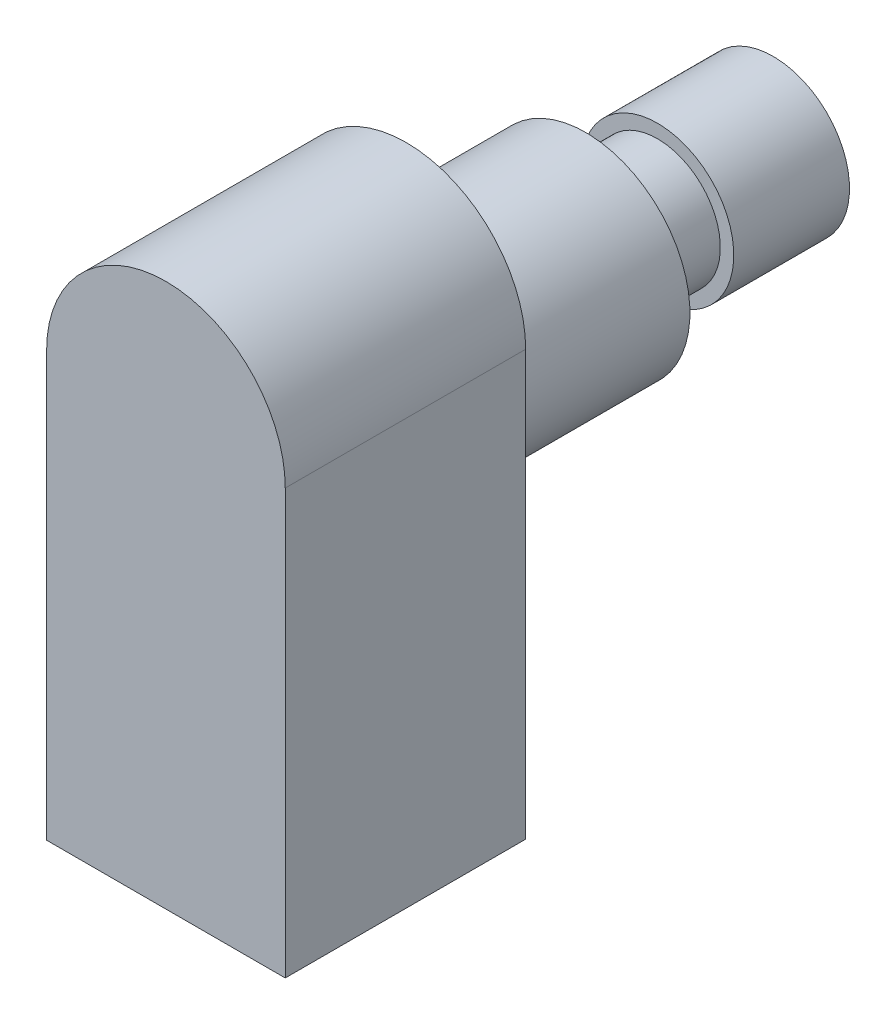
ISO-10303-21;
HEADER;
FILE_DESCRIPTION(('STEP AP214'),'2;1');
FILE_NAME('part.step','',(''),(''),'','','');
FILE_SCHEMA(('AUTOMOTIVE_DESIGN { 1 0 10303 214 1 1 1 1 }'));
ENDSEC;
DATA;
#1=APPLICATION_CONTEXT('core data for automotive mechanical design processes');
#2=APPLICATION_PROTOCOL_DEFINITION('international standard','automotive_design',2000,#1);
#3=PRODUCT_CONTEXT('',#1,'mechanical');
#4=PRODUCT('Part','Part','',(#3));
#5=PRODUCT_RELATED_PRODUCT_CATEGORY('part','',(#4));
#6=PRODUCT_DEFINITION_FORMATION('','',#4);
#7=PRODUCT_DEFINITION_CONTEXT('part definition',#1,'design');
#8=PRODUCT_DEFINITION('design','',#6,#7);
#9=PRODUCT_DEFINITION_SHAPE('','',#8);
#10=(LENGTH_UNIT() NAMED_UNIT(*) SI_UNIT(.MILLI.,.METRE.));
#11=(NAMED_UNIT(*) PLANE_ANGLE_UNIT() SI_UNIT($,.RADIAN.));
#12=(NAMED_UNIT(*) SI_UNIT($,.STERADIAN.) SOLID_ANGLE_UNIT());
#13=UNCERTAINTY_MEASURE_WITH_UNIT(LENGTH_MEASURE(1.E-05),#10,'distance_accuracy_value','');
#14=(GEOMETRIC_REPRESENTATION_CONTEXT(3) GLOBAL_UNCERTAINTY_ASSIGNED_CONTEXT((#13)) GLOBAL_UNIT_ASSIGNED_CONTEXT((#10,
#11,#12)) REPRESENTATION_CONTEXT('',''));
#15=CARTESIAN_POINT('',(0.,0.,0.));
#16=DIRECTION('',(0.,0.,1.));
#17=DIRECTION('',(1.,0.,0.));
#18=AXIS2_PLACEMENT_3D('',#15,#16,#17);
#19=CARTESIAN_POINT('',(0.,0.,13.4));
#20=DIRECTION('',(0.,0.,-1.));
#21=DIRECTION('',(-1.,0.,0.));
#22=AXIS2_PLACEMENT_3D('',#19,#20,#21);
#23=CYLINDRICAL_SURFACE('',#22,6.65);
#24=CARTESIAN_POINT('',(0.,0.,0.));
#25=DIRECTION('',(0.,0.,1.));
#26=DIRECTION('',(1.,0.,0.));
#27=AXIS2_PLACEMENT_3D('',#24,#25,#26);
#28=CIRCLE('',#27,6.65);
#29=CARTESIAN_POINT('',(6.65,0.,0.));
#30=VERTEX_POINT('',#29);
#31=CARTESIAN_POINT('',(-6.65,0.,0.));
#32=VERTEX_POINT('',#31);
#33=EDGE_CURVE('E100',#30,#32,#28,.T.);
#34=ORIENTED_EDGE('',*,*,#33,.T.);
#35=DIRECTION('',(0.,0.,-1.));
#36=VECTOR('',#35,1.);
#37=CARTESIAN_POINT('',(-6.65,0.,13.4));
#38=LINE('',#37,#36);
#39=CARTESIAN_POINT('',(-6.65,0.,13.4));
#40=VERTEX_POINT('',#39);
#41=EDGE_CURVE('E36',#40,#32,#38,.T.);
#42=ORIENTED_EDGE('',*,*,#41,.F.);
#43=CARTESIAN_POINT('',(0.,0.,13.4));
#44=DIRECTION('',(0.,0.,1.));
#45=DIRECTION('',(1.,0.,0.));
#46=AXIS2_PLACEMENT_3D('',#43,#44,#45);
#47=CIRCLE('',#46,6.65);
#48=CARTESIAN_POINT('',(6.65,0.,13.4));
#49=VERTEX_POINT('',#48);
#50=EDGE_CURVE('E87',#49,#40,#47,.T.);
#51=ORIENTED_EDGE('',*,*,#50,.F.);
#52=DIRECTION('',(0.,0.,-1.));
#53=VECTOR('',#52,1.);
#54=CARTESIAN_POINT('',(6.65,0.,13.4));
#55=LINE('',#54,#53);
#56=EDGE_CURVE('E96',#49,#30,#55,.T.);
#57=ORIENTED_EDGE('',*,*,#56,.T.);
#58=EDGE_LOOP('',(#34,#42,#51,#57));
#59=FACE_BOUND('',#58,.T.);
#60=ADVANCED_FACE('F33',(#59),#23,.T.);
#61=CARTESIAN_POINT('',(-6.65,0.,13.4));
#62=DIRECTION('',(1.,0.,0.));
#63=DIRECTION('',(0.,1.,0.));
#64=AXIS2_PLACEMENT_3D('',#61,#62,#63);
#65=PLANE('',#64);
#66=DIRECTION('',(0.,-1.,0.));
#67=VECTOR('',#66,1.);
#68=CARTESIAN_POINT('',(-6.65,0.,0.));
#69=LINE('',#68,#67);
#70=CARTESIAN_POINT('',(-6.65,-23.65,0.));
#71=VERTEX_POINT('',#70);
#72=EDGE_CURVE('E92',#32,#71,#69,.T.);
#73=ORIENTED_EDGE('',*,*,#72,.T.);
#74=DIRECTION('',(0.,0.,-1.));
#75=VECTOR('',#74,1.);
#76=CARTESIAN_POINT('',(-6.65,-23.65,13.4));
#77=LINE('',#76,#75);
#78=CARTESIAN_POINT('',(-6.65,-23.65,13.4));
#79=VERTEX_POINT('',#78);
#80=EDGE_CURVE('E90',#79,#71,#77,.T.);
#81=ORIENTED_EDGE('',*,*,#80,.F.);
#82=DIRECTION('',(0.,-1.,0.));
#83=VECTOR('',#82,1.);
#84=CARTESIAN_POINT('',(-6.65,0.,13.4));
#85=LINE('',#84,#83);
#86=EDGE_CURVE('E82',#40,#79,#85,.T.);
#87=ORIENTED_EDGE('',*,*,#86,.F.);
#88=ORIENTED_EDGE('',*,*,#41,.T.);
#89=EDGE_LOOP('',(#73,#81,#87,#88));
#90=FACE_BOUND('',#89,.T.);
#91=ADVANCED_FACE('F91',(#90),#65,.F.);
#92=CARTESIAN_POINT('',(-6.65,-23.65,13.4));
#93=DIRECTION('',(0.,1.,0.));
#94=DIRECTION('',(0.,0.,1.));
#95=AXIS2_PLACEMENT_3D('',#92,#93,#94);
#96=PLANE('',#95);
#97=DIRECTION('',(1.,0.,0.));
#98=VECTOR('',#97,1.);
#99=CARTESIAN_POINT('',(-6.65,-23.65,0.));
#100=LINE('',#99,#98);
#101=CARTESIAN_POINT('',(6.65,-23.65,0.));
#102=VERTEX_POINT('',#101);
#103=EDGE_CURVE('E68',#71,#102,#100,.T.);
#104=ORIENTED_EDGE('',*,*,#103,.T.);
#105=DIRECTION('',(0.,0.,-1.));
#106=VECTOR('',#105,1.);
#107=CARTESIAN_POINT('',(6.65,-23.65,13.4));
#108=LINE('',#107,#106);
#109=CARTESIAN_POINT('',(6.65,-23.65,13.4));
#110=VERTEX_POINT('',#109);
#111=EDGE_CURVE('E93',#110,#102,#108,.T.);
#112=ORIENTED_EDGE('',*,*,#111,.F.);
#113=DIRECTION('',(1.,0.,0.));
#114=VECTOR('',#113,1.);
#115=CARTESIAN_POINT('',(-6.65,-23.65,13.4));
#116=LINE('',#115,#114);
#117=EDGE_CURVE('E85',#79,#110,#116,.T.);
#118=ORIENTED_EDGE('',*,*,#117,.F.);
#119=ORIENTED_EDGE('',*,*,#80,.T.);
#120=EDGE_LOOP('',(#104,#112,#118,#119));
#121=FACE_BOUND('',#120,.T.);
#122=ADVANCED_FACE('F94',(#121),#96,.F.);
#123=CARTESIAN_POINT('',(6.65,-23.65,13.4));
#124=DIRECTION('',(-1.,0.,0.));
#125=DIRECTION('',(0.,-1.,0.));
#126=AXIS2_PLACEMENT_3D('',#123,#124,#125);
#127=PLANE('',#126);
#128=DIRECTION('',(0.,1.,0.));
#129=VECTOR('',#128,1.);
#130=CARTESIAN_POINT('',(6.65,-23.65,0.));
#131=LINE('',#130,#129);
#132=EDGE_CURVE('E74',#102,#30,#131,.T.);
#133=ORIENTED_EDGE('',*,*,#132,.T.);
#134=ORIENTED_EDGE('',*,*,#56,.F.);
#135=DIRECTION('',(0.,1.,0.));
#136=VECTOR('',#135,1.);
#137=CARTESIAN_POINT('',(6.65,-23.65,13.4));
#138=LINE('',#137,#136);
#139=EDGE_CURVE('E51',#110,#49,#138,.T.);
#140=ORIENTED_EDGE('',*,*,#139,.F.);
#141=ORIENTED_EDGE('',*,*,#111,.T.);
#142=EDGE_LOOP('',(#133,#134,#140,#141));
#143=FACE_BOUND('',#142,.T.);
#144=ADVANCED_FACE('F108',(#143),#127,.F.);
#145=CARTESIAN_POINT('',(0.,0.,13.4));
#146=DIRECTION('',(0.,0.,1.));
#147=DIRECTION('',(1.,0.,0.));
#148=AXIS2_PLACEMENT_3D('',#145,#146,#147);
#149=PLANE('',#148);
#150=ORIENTED_EDGE('',*,*,#50,.T.);
#151=ORIENTED_EDGE('',*,*,#86,.T.);
#152=ORIENTED_EDGE('',*,*,#117,.T.);
#153=ORIENTED_EDGE('',*,*,#139,.T.);
#154=EDGE_LOOP('',(#150,#151,#152,#153));
#155=FACE_BOUND('',#154,.T.);
#156=ADVANCED_FACE('F83',(#155),#149,.T.);
#157=CARTESIAN_POINT('',(0.,0.,0.));
#158=DIRECTION('',(0.,0.,1.));
#159=DIRECTION('',(1.,0.,0.));
#160=AXIS2_PLACEMENT_3D('',#157,#158,#159);
#161=PLANE('',#160);
#162=CARTESIAN_POINT('',(0.,-3.665,0.));
#163=DIRECTION('',(0.,0.,-1.));
#164=DIRECTION('',(-1.,0.,0.));
#165=AXIS2_PLACEMENT_3D('',#162,#163,#164);
#166=CIRCLE('',#165,5.805);
#167=CARTESIAN_POINT('',(-5.805,-3.665,0.));
#168=VERTEX_POINT('',#167);
#169=EDGE_CURVE('E42',#168,#168,#166,.T.);
#170=ORIENTED_EDGE('',*,*,#169,.F.);
#171=EDGE_LOOP('',(#170));
#172=FACE_BOUND('',#171,.T.);
#173=ORIENTED_EDGE('',*,*,#33,.F.);
#174=ORIENTED_EDGE('',*,*,#132,.F.);
#175=ORIENTED_EDGE('',*,*,#103,.F.);
#176=ORIENTED_EDGE('',*,*,#72,.F.);
#177=EDGE_LOOP('',(#173,#174,#175,#176));
#178=FACE_BOUND('',#177,.T.);
#179=ADVANCED_FACE('F111',(#172,#178),#161,.F.);
#180=CARTESIAN_POINT('',(0.,-3.665,-10.));
#181=DIRECTION('',(0.,0.,1.));
#182=DIRECTION('',(1.,0.,0.));
#183=AXIS2_PLACEMENT_3D('',#180,#181,#182);
#184=CYLINDRICAL_SURFACE('',#183,5.805);
#185=CARTESIAN_POINT('',(0.,-3.665,-10.));
#186=DIRECTION('',(0.,0.,-1.));
#187=DIRECTION('',(-1.,0.,0.));
#188=AXIS2_PLACEMENT_3D('',#185,#186,#187);
#189=CIRCLE('',#188,5.805);
#190=CARTESIAN_POINT('',(-5.805,-3.665,-10.));
#191=VERTEX_POINT('',#190);
#192=EDGE_CURVE('E103',#191,#191,#189,.T.);
#193=ORIENTED_EDGE('',*,*,#192,.F.);
#194=EDGE_LOOP('',(#193));
#195=FACE_BOUND('',#194,.T.);
#196=ORIENTED_EDGE('',*,*,#169,.T.);
#197=EDGE_LOOP('',(#196));
#198=FACE_BOUND('',#197,.T.);
#199=ADVANCED_FACE('F158',(#195,#198),#184,.T.);
#200=CARTESIAN_POINT('',(0.,-3.665,-10.));
#201=DIRECTION('',(0.,0.,-1.));
#202=DIRECTION('',(-1.,0.,0.));
#203=AXIS2_PLACEMENT_3D('',#200,#201,#202);
#204=PLANE('',#203);
#205=CARTESIAN_POINT('',(0.,-3.665,-10.));
#206=DIRECTION('',(0.,0.,-1.));
#207=DIRECTION('',(-1.,0.,0.));
#208=AXIS2_PLACEMENT_3D('',#205,#206,#207);
#209=CIRCLE('',#208,3.5);
#210=CARTESIAN_POINT('',(-3.5,-3.665,-10.));
#211=VERTEX_POINT('',#210);
#212=EDGE_CURVE('E11',#211,#211,#209,.T.);
#213=ORIENTED_EDGE('',*,*,#212,.F.);
#214=EDGE_LOOP('',(#213));
#215=FACE_BOUND('',#214,.T.);
#216=ORIENTED_EDGE('',*,*,#192,.T.);
#217=EDGE_LOOP('',(#216));
#218=FACE_BOUND('',#217,.T.);
#219=ADVANCED_FACE('F164',(#215,#218),#204,.T.);
#220=CARTESIAN_POINT('',(0.,-3.665,-14.));
#221=DIRECTION('',(0.,0.,1.));
#222=DIRECTION('',(1.,0.,0.));
#223=AXIS2_PLACEMENT_3D('',#220,#221,#222);
#224=CYLINDRICAL_SURFACE('',#223,3.5);
#225=CARTESIAN_POINT('',(0.,-3.665,-14.));
#226=DIRECTION('',(0.,0.,-1.));
#227=DIRECTION('',(-1.,0.,0.));
#228=AXIS2_PLACEMENT_3D('',#225,#226,#227);
#229=CIRCLE('',#228,3.5);
#230=CARTESIAN_POINT('',(-3.5,-3.665,-14.));
#231=VERTEX_POINT('',#230);
#232=EDGE_CURVE('E117',#231,#231,#229,.T.);
#233=ORIENTED_EDGE('',*,*,#232,.F.);
#234=EDGE_LOOP('',(#233));
#235=FACE_BOUND('',#234,.T.);
#236=ORIENTED_EDGE('',*,*,#212,.T.);
#237=EDGE_LOOP('',(#236));
#238=FACE_BOUND('',#237,.T.);
#239=ADVANCED_FACE('F133',(#235,#238),#224,.T.);
#240=CARTESIAN_POINT('',(0.,-3.665,-20.45));
#241=DIRECTION('',(0.,0.,1.));
#242=DIRECTION('',(1.,0.,0.));
#243=AXIS2_PLACEMENT_3D('',#240,#241,#242);
#244=CYLINDRICAL_SURFACE('',#243,4.25);
#245=CARTESIAN_POINT('',(0.,-3.665,-20.45));
#246=DIRECTION('',(0.,0.,-1.));
#247=DIRECTION('',(-1.,0.,0.));
#248=AXIS2_PLACEMENT_3D('',#245,#246,#247);
#249=CIRCLE('',#248,4.25);
#250=CARTESIAN_POINT('',(-4.25,-3.665,-20.45));
#251=VERTEX_POINT('',#250);
#252=EDGE_CURVE('E121',#251,#251,#249,.T.);
#253=ORIENTED_EDGE('',*,*,#252,.F.);
#254=EDGE_LOOP('',(#253));
#255=FACE_BOUND('',#254,.T.);
#256=CARTESIAN_POINT('',(0.,-3.665,-14.));
#257=DIRECTION('',(0.,0.,-1.));
#258=DIRECTION('',(-1.,0.,0.));
#259=AXIS2_PLACEMENT_3D('',#256,#257,#258);
#260=CIRCLE('',#259,4.25);
#261=CARTESIAN_POINT('',(-4.25,-3.665,-14.));
#262=VERTEX_POINT('',#261);
#263=EDGE_CURVE('E122',#262,#262,#260,.T.);
#264=ORIENTED_EDGE('',*,*,#263,.T.);
#265=EDGE_LOOP('',(#264));
#266=FACE_BOUND('',#265,.T.);
#267=ADVANCED_FACE('F130',(#255,#266),#244,.T.);
#268=CARTESIAN_POINT('',(0.,-3.665,-20.45));
#269=DIRECTION('',(0.,0.,-1.));
#270=DIRECTION('',(-1.,0.,0.));
#271=AXIS2_PLACEMENT_3D('',#268,#269,#270);
#272=PLANE('',#271);
#273=ORIENTED_EDGE('',*,*,#252,.T.);
#274=EDGE_LOOP('',(#273));
#275=FACE_BOUND('',#274,.T.);
#276=ADVANCED_FACE('F128',(#275),#272,.T.);
#277=CARTESIAN_POINT('',(0.,-3.665,-14.));
#278=DIRECTION('',(0.,0.,-1.));
#279=DIRECTION('',(-1.,0.,0.));
#280=AXIS2_PLACEMENT_3D('',#277,#278,#279);
#281=PLANE('',#280);
#282=ORIENTED_EDGE('',*,*,#232,.T.);
#283=EDGE_LOOP('',(#282));
#284=FACE_BOUND('',#283,.T.);
#285=ORIENTED_EDGE('',*,*,#263,.F.);
#286=EDGE_LOOP('',(#285));
#287=FACE_BOUND('',#286,.T.);
#288=ADVANCED_FACE('F137',(#284,#287),#281,.F.);
#289=CLOSED_SHELL('',(#60,#91,#122,#144,#156,#179,#199,#219,#239,#267,#276,#288));
#290=MANIFOLD_SOLID_BREP('B2',#289);
#291=ADVANCED_BREP_SHAPE_REPRESENTATION('',(#18,#290),#14);
#292=SHAPE_DEFINITION_REPRESENTATION(#9,#291);
ENDSEC;
END-ISO-10303-21;
